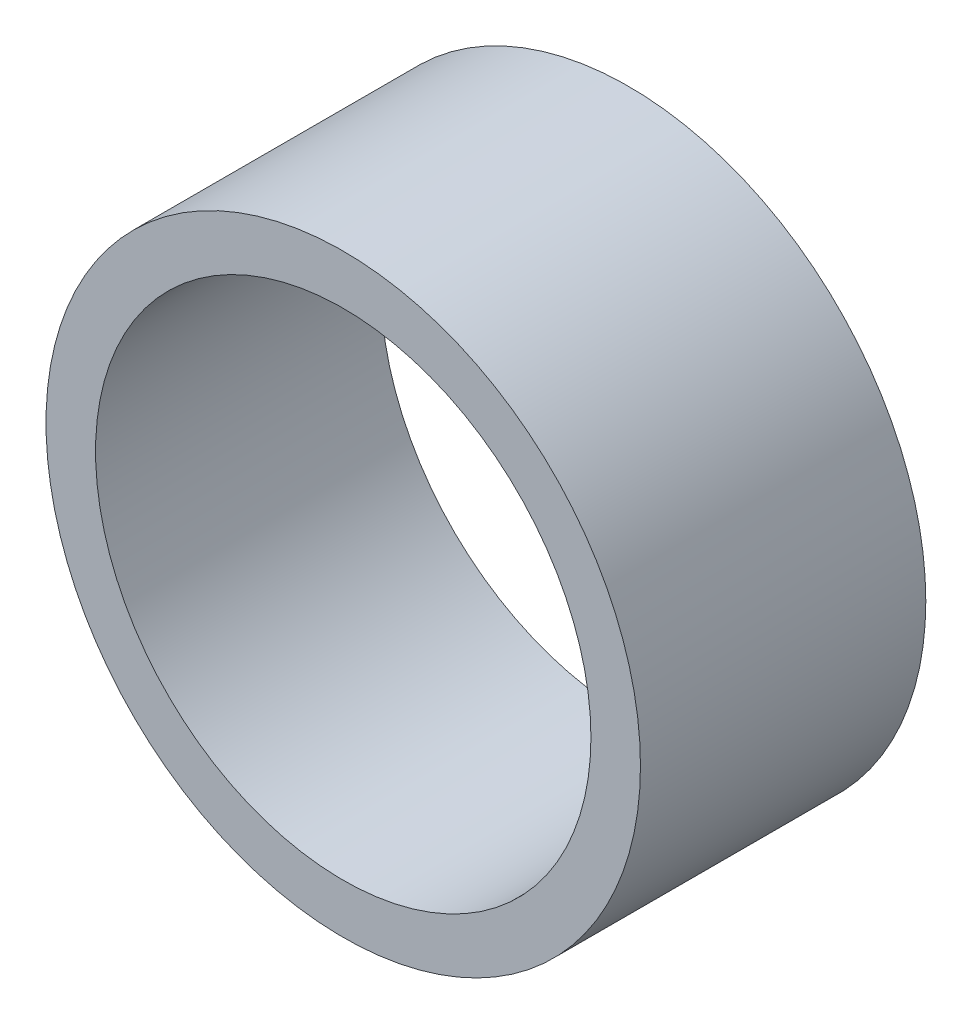
ISO-10303-21;
HEADER;
FILE_DESCRIPTION(('STEP AP214'),'2;1');
FILE_NAME('part.step','',(''),(''),'','','');
FILE_SCHEMA(('AUTOMOTIVE_DESIGN { 1 0 10303 214 1 1 1 1 }'));
ENDSEC;
DATA;
#1=APPLICATION_CONTEXT('core data for automotive mechanical design processes');
#2=APPLICATION_PROTOCOL_DEFINITION('international standard','automotive_design',2000,#1);
#3=PRODUCT_CONTEXT('',#1,'mechanical');
#4=PRODUCT('Part','Part','',(#3));
#5=PRODUCT_RELATED_PRODUCT_CATEGORY('part','',(#4));
#6=PRODUCT_DEFINITION_FORMATION('','',#4);
#7=PRODUCT_DEFINITION_CONTEXT('part definition',#1,'design');
#8=PRODUCT_DEFINITION('design','',#6,#7);
#9=PRODUCT_DEFINITION_SHAPE('','',#8);
#10=(LENGTH_UNIT() NAMED_UNIT(*) SI_UNIT(.MILLI.,.METRE.));
#11=(NAMED_UNIT(*) PLANE_ANGLE_UNIT() SI_UNIT($,.RADIAN.));
#12=(NAMED_UNIT(*) SI_UNIT($,.STERADIAN.) SOLID_ANGLE_UNIT());
#13=UNCERTAINTY_MEASURE_WITH_UNIT(LENGTH_MEASURE(1.E-05),#10,'distance_accuracy_value','');
#14=(GEOMETRIC_REPRESENTATION_CONTEXT(3) GLOBAL_UNCERTAINTY_ASSIGNED_CONTEXT((#13)) GLOBAL_UNIT_ASSIGNED_CONTEXT((#10,
#11,#12)) REPRESENTATION_CONTEXT('',''));
#15=CARTESIAN_POINT('',(0.,0.,0.));
#16=DIRECTION('',(0.,0.,1.));
#17=DIRECTION('',(1.,0.,0.));
#18=AXIS2_PLACEMENT_3D('',#15,#16,#17);
#19=CARTESIAN_POINT('',(0.,0.,14.4));
#20=DIRECTION('',(0.,0.,1.));
#21=DIRECTION('',(1.,0.,0.));
#22=AXIS2_PLACEMENT_3D('',#19,#20,#21);
#23=PLANE('',#22);
#24=CARTESIAN_POINT('',(0.,0.,14.4));
#25=DIRECTION('',(0.,0.,1.));
#26=DIRECTION('',(1.,0.,0.));
#27=AXIS2_PLACEMENT_3D('',#24,#25,#26);
#28=CIRCLE('',#27,15.);
#29=CARTESIAN_POINT('',(15.,0.,14.4));
#30=VERTEX_POINT('',#29);
#31=EDGE_CURVE('E10',#30,#30,#28,.T.);
#32=ORIENTED_EDGE('',*,*,#31,.T.);
#33=EDGE_LOOP('',(#32));
#34=FACE_BOUND('',#33,.T.);
#35=CARTESIAN_POINT('',(0.,0.,14.4));
#36=DIRECTION('',(0.,0.,1.));
#37=DIRECTION('',(1.,0.,0.));
#38=AXIS2_PLACEMENT_3D('',#35,#36,#37);
#39=CIRCLE('',#38,12.5);
#40=CARTESIAN_POINT('',(12.5,0.,14.4));
#41=VERTEX_POINT('',#40);
#42=EDGE_CURVE('E43',#41,#41,#39,.T.);
#43=ORIENTED_EDGE('',*,*,#42,.F.);
#44=EDGE_LOOP('',(#43));
#45=FACE_BOUND('',#44,.T.);
#46=ADVANCED_FACE('F32',(#34,#45),#23,.T.);
#47=CARTESIAN_POINT('',(0.,0.,0.));
#48=DIRECTION('',(0.,0.,1.));
#49=DIRECTION('',(1.,0.,0.));
#50=AXIS2_PLACEMENT_3D('',#47,#48,#49);
#51=PLANE('',#50);
#52=CARTESIAN_POINT('',(0.,0.,0.));
#53=DIRECTION('',(0.,0.,1.));
#54=DIRECTION('',(1.,0.,0.));
#55=AXIS2_PLACEMENT_3D('',#52,#53,#54);
#56=CIRCLE('',#55,15.);
#57=CARTESIAN_POINT('',(15.,0.,0.));
#58=VERTEX_POINT('',#57);
#59=EDGE_CURVE('E36',#58,#58,#56,.T.);
#60=ORIENTED_EDGE('',*,*,#59,.F.);
#61=EDGE_LOOP('',(#60));
#62=FACE_BOUND('',#61,.T.);
#63=CARTESIAN_POINT('',(0.,0.,0.));
#64=DIRECTION('',(0.,0.,1.));
#65=DIRECTION('',(1.,0.,0.));
#66=AXIS2_PLACEMENT_3D('',#63,#64,#65);
#67=CIRCLE('',#66,12.5);
#68=CARTESIAN_POINT('',(12.5,0.,0.));
#69=VERTEX_POINT('',#68);
#70=EDGE_CURVE('E45',#69,#69,#67,.T.);
#71=ORIENTED_EDGE('',*,*,#70,.T.);
#72=EDGE_LOOP('',(#71));
#73=FACE_BOUND('',#72,.T.);
#74=ADVANCED_FACE('F55',(#62,#73),#51,.F.);
#75=CARTESIAN_POINT('',(0.,0.,14.4));
#76=DIRECTION('',(0.,0.,-1.));
#77=DIRECTION('',(-1.,0.,0.));
#78=AXIS2_PLACEMENT_3D('',#75,#76,#77);
#79=CYLINDRICAL_SURFACE('',#78,15.);
#80=ORIENTED_EDGE('',*,*,#31,.F.);
#81=EDGE_LOOP('',(#80));
#82=FACE_BOUND('',#81,.T.);
#83=ORIENTED_EDGE('',*,*,#59,.T.);
#84=EDGE_LOOP('',(#83));
#85=FACE_BOUND('',#84,.T.);
#86=ADVANCED_FACE('F34',(#82,#85),#79,.T.);
#87=CARTESIAN_POINT('',(0.,0.,14.4));
#88=DIRECTION('',(0.,0.,-1.));
#89=DIRECTION('',(-1.,0.,0.));
#90=AXIS2_PLACEMENT_3D('',#87,#88,#89);
#91=CYLINDRICAL_SURFACE('',#90,12.5);
#92=ORIENTED_EDGE('',*,*,#42,.T.);
#93=EDGE_LOOP('',(#92));
#94=FACE_BOUND('',#93,.T.);
#95=ORIENTED_EDGE('',*,*,#70,.F.);
#96=EDGE_LOOP('',(#95));
#97=FACE_BOUND('',#96,.T.);
#98=ADVANCED_FACE('F51',(#94,#97),#91,.F.);
#99=CLOSED_SHELL('',(#46,#74,#86,#98));
#100=MANIFOLD_SOLID_BREP('B2',#99);
#101=ADVANCED_BREP_SHAPE_REPRESENTATION('',(#18,#100),#14);
#102=SHAPE_DEFINITION_REPRESENTATION(#9,#101);
ENDSEC;
END-ISO-10303-21;
